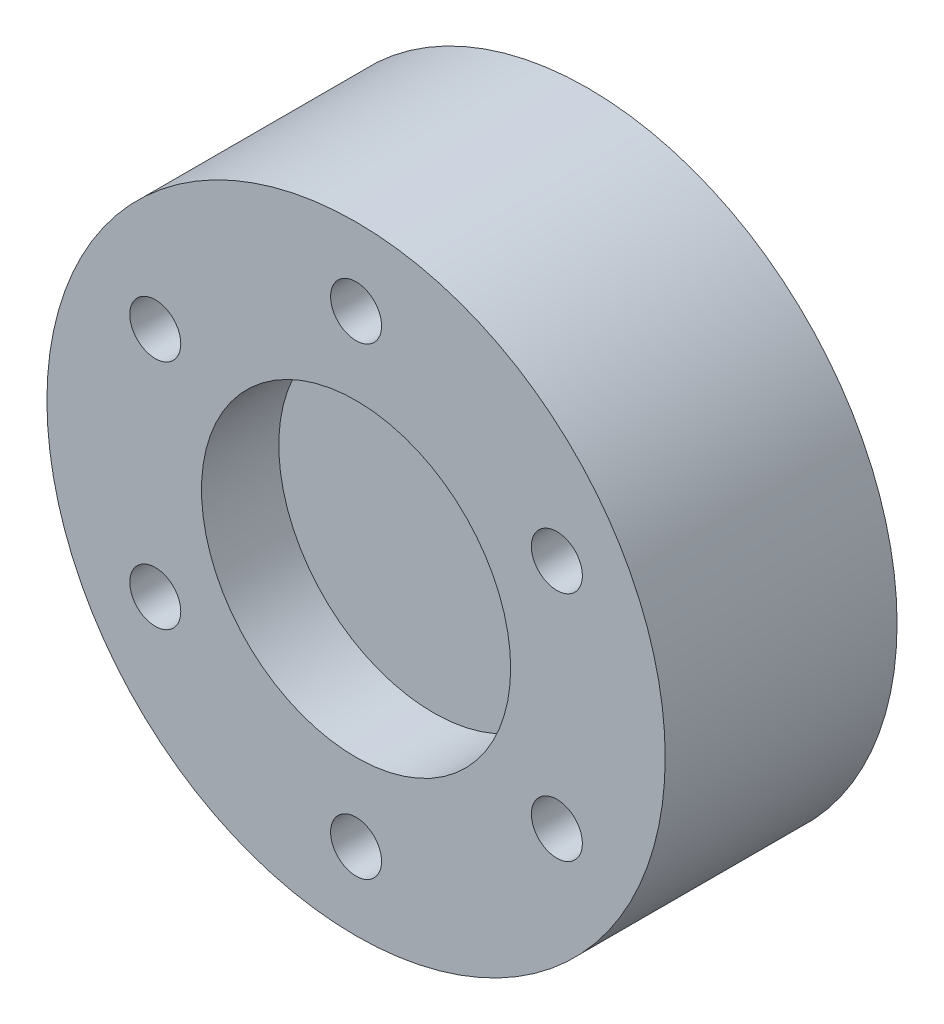
ISO-10303-21;
HEADER;
FILE_DESCRIPTION(('STEP AP214'),'2;1');
FILE_NAME('part.step','',(''),(''),'','','');
FILE_SCHEMA(('AUTOMOTIVE_DESIGN { 1 0 10303 214 1 1 1 1 }'));
ENDSEC;
DATA;
#1=APPLICATION_CONTEXT('core data for automotive mechanical design processes');
#2=APPLICATION_PROTOCOL_DEFINITION('international standard','automotive_design',2000,#1);
#3=PRODUCT_CONTEXT('',#1,'mechanical');
#4=PRODUCT('Part','Part','',(#3));
#5=PRODUCT_RELATED_PRODUCT_CATEGORY('part','',(#4));
#6=PRODUCT_DEFINITION_FORMATION('','',#4);
#7=PRODUCT_DEFINITION_CONTEXT('part definition',#1,'design');
#8=PRODUCT_DEFINITION('design','',#6,#7);
#9=PRODUCT_DEFINITION_SHAPE('','',#8);
#10=(LENGTH_UNIT() NAMED_UNIT(*) SI_UNIT(.MILLI.,.METRE.));
#11=(NAMED_UNIT(*) PLANE_ANGLE_UNIT() SI_UNIT($,.RADIAN.));
#12=(NAMED_UNIT(*) SI_UNIT($,.STERADIAN.) SOLID_ANGLE_UNIT());
#13=UNCERTAINTY_MEASURE_WITH_UNIT(LENGTH_MEASURE(1.E-05),#10,'distance_accuracy_value','');
#14=(GEOMETRIC_REPRESENTATION_CONTEXT(3) GLOBAL_UNCERTAINTY_ASSIGNED_CONTEXT((#13)) GLOBAL_UNIT_ASSIGNED_CONTEXT((#10,
#11,#12)) REPRESENTATION_CONTEXT('',''));
#15=CARTESIAN_POINT('',(0.,0.,0.));
#16=DIRECTION('',(0.,0.,1.));
#17=DIRECTION('',(1.,0.,0.));
#18=AXIS2_PLACEMENT_3D('',#15,#16,#17);
#19=CARTESIAN_POINT('',(0.,0.,15.));
#20=DIRECTION('',(0.,0.,-1.));
#21=DIRECTION('',(-1.,0.,0.));
#22=AXIS2_PLACEMENT_3D('',#19,#20,#21);
#23=CYLINDRICAL_SURFACE('',#22,20.);
#24=CARTESIAN_POINT('',(0.,0.,15.));
#25=DIRECTION('',(0.,0.,1.));
#26=DIRECTION('',(1.,0.,0.));
#27=AXIS2_PLACEMENT_3D('',#24,#25,#26);
#28=CIRCLE('',#27,20.);
#29=CARTESIAN_POINT('',(20.,0.,15.));
#30=VERTEX_POINT('',#29);
#31=EDGE_CURVE('E11',#30,#30,#28,.T.);
#32=ORIENTED_EDGE('',*,*,#31,.F.);
#33=EDGE_LOOP('',(#32));
#34=FACE_BOUND('',#33,.T.);
#35=CARTESIAN_POINT('',(0.,0.,0.));
#36=DIRECTION('',(0.,0.,1.));
#37=DIRECTION('',(1.,0.,0.));
#38=AXIS2_PLACEMENT_3D('',#35,#36,#37);
#39=CIRCLE('',#38,20.);
#40=CARTESIAN_POINT('',(20.,0.,0.));
#41=VERTEX_POINT('',#40);
#42=EDGE_CURVE('E41',#41,#41,#39,.T.);
#43=ORIENTED_EDGE('',*,*,#42,.T.);
#44=EDGE_LOOP('',(#43));
#45=FACE_BOUND('',#44,.T.);
#46=ADVANCED_FACE('F38',(#34,#45),#23,.T.);
#47=CARTESIAN_POINT('',(0.,0.,15.));
#48=DIRECTION('',(0.,0.,1.));
#49=DIRECTION('',(1.,0.,0.));
#50=AXIS2_PLACEMENT_3D('',#47,#48,#49);
#51=PLANE('',#50);
#52=CARTESIAN_POINT('',(12.9903810567665,7.50000000000015,15.));
#53=DIRECTION('',(0.,0.,1.));
#54=DIRECTION('',(1.,0.,0.));
#55=AXIS2_PLACEMENT_3D('',#52,#53,#54);
#56=CIRCLE('',#55,1.64999999999999);
#57=CARTESIAN_POINT('',(14.6403810567665,7.50000000000015,15.));
#58=VERTEX_POINT('',#57);
#59=EDGE_CURVE('E75',#58,#58,#56,.T.);
#60=ORIENTED_EDGE('',*,*,#59,.F.);
#61=EDGE_LOOP('',(#60));
#62=FACE_BOUND('',#61,.T.);
#63=CARTESIAN_POINT('',(12.9903810567666,-7.49999999999988,15.));
#64=DIRECTION('',(0.,0.,1.));
#65=DIRECTION('',(1.,0.,0.));
#66=AXIS2_PLACEMENT_3D('',#63,#64,#65);
#67=CIRCLE('',#66,1.64999999999999);
#68=CARTESIAN_POINT('',(14.6403810567666,-7.49999999999988,15.));
#69=VERTEX_POINT('',#68);
#70=EDGE_CURVE('E74',#69,#69,#67,.T.);
#71=ORIENTED_EDGE('',*,*,#70,.F.);
#72=EDGE_LOOP('',(#71));
#73=FACE_BOUND('',#72,.T.);
#74=CARTESIAN_POINT('',(0.,-15.,15.));
#75=DIRECTION('',(0.,0.,1.));
#76=DIRECTION('',(1.,0.,0.));
#77=AXIS2_PLACEMENT_3D('',#74,#75,#76);
#78=CIRCLE('',#77,1.64999999999999);
#79=CARTESIAN_POINT('',(1.64999999999999,-15.,15.));
#80=VERTEX_POINT('',#79);
#81=EDGE_CURVE('E87',#80,#80,#78,.T.);
#82=ORIENTED_EDGE('',*,*,#81,.F.);
#83=EDGE_LOOP('',(#82));
#84=FACE_BOUND('',#83,.T.);
#85=CARTESIAN_POINT('',(-12.9903810567665,-7.50000000000006,15.));
#86=DIRECTION('',(0.,0.,1.));
#87=DIRECTION('',(1.,0.,0.));
#88=AXIS2_PLACEMENT_3D('',#85,#86,#87);
#89=CIRCLE('',#88,1.64999999999999);
#90=CARTESIAN_POINT('',(-11.3403810567666,-7.50000000000006,15.));
#91=VERTEX_POINT('',#90);
#92=EDGE_CURVE('E93',#91,#91,#89,.T.);
#93=ORIENTED_EDGE('',*,*,#92,.F.);
#94=EDGE_LOOP('',(#93));
#95=FACE_BOUND('',#94,.T.);
#96=CARTESIAN_POINT('',(-12.9903810567666,7.49999999999997,15.));
#97=DIRECTION('',(0.,0.,1.));
#98=DIRECTION('',(1.,0.,0.));
#99=AXIS2_PLACEMENT_3D('',#96,#97,#98);
#100=CIRCLE('',#99,1.64999999999999);
#101=CARTESIAN_POINT('',(-11.3403810567666,7.49999999999997,15.));
#102=VERTEX_POINT('',#101);
#103=EDGE_CURVE('E99',#102,#102,#100,.T.);
#104=ORIENTED_EDGE('',*,*,#103,.F.);
#105=EDGE_LOOP('',(#104));
#106=FACE_BOUND('',#105,.T.);
#107=CARTESIAN_POINT('',(0.,15.,15.));
#108=DIRECTION('',(0.,0.,1.));
#109=DIRECTION('',(1.,0.,0.));
#110=AXIS2_PLACEMENT_3D('',#107,#108,#109);
#111=CIRCLE('',#110,1.64999999999999);
#112=CARTESIAN_POINT('',(1.64999999999999,15.,15.));
#113=VERTEX_POINT('',#112);
#114=EDGE_CURVE('E105',#113,#113,#111,.T.);
#115=ORIENTED_EDGE('',*,*,#114,.F.);
#116=EDGE_LOOP('',(#115));
#117=FACE_BOUND('',#116,.T.);
#118=CARTESIAN_POINT('',(0.,0.,15.));
#119=DIRECTION('',(0.,0.,1.));
#120=DIRECTION('',(1.,0.,0.));
#121=AXIS2_PLACEMENT_3D('',#118,#119,#120);
#122=CIRCLE('',#121,10.);
#123=CARTESIAN_POINT('',(10.,0.,15.));
#124=VERTEX_POINT('',#123);
#125=EDGE_CURVE('E111',#124,#124,#122,.T.);
#126=ORIENTED_EDGE('',*,*,#125,.F.);
#127=EDGE_LOOP('',(#126));
#128=FACE_BOUND('',#127,.T.);
#129=ORIENTED_EDGE('',*,*,#31,.T.);
#130=EDGE_LOOP('',(#129));
#131=FACE_BOUND('',#130,.T.);
#132=ADVANCED_FACE('F120',(#62,#73,#84,#95,#106,#117,#128,#131),#51,.T.);
#133=CARTESIAN_POINT('',(0.,0.,0.));
#134=DIRECTION('',(0.,0.,1.));
#135=DIRECTION('',(1.,0.,0.));
#136=AXIS2_PLACEMENT_3D('',#133,#134,#135);
#137=PLANE('',#136);
#138=CARTESIAN_POINT('',(0.,0.,0.));
#139=DIRECTION('',(0.,0.,-1.));
#140=DIRECTION('',(-1.,0.,0.));
#141=AXIS2_PLACEMENT_3D('',#138,#139,#140);
#142=CIRCLE('',#141,17.5);
#143=CARTESIAN_POINT('',(-17.5,0.,0.));
#144=VERTEX_POINT('',#143);
#145=EDGE_CURVE('E196',#144,#144,#142,.T.);
#146=ORIENTED_EDGE('',*,*,#145,.F.);
#147=EDGE_LOOP('',(#146));
#148=FACE_BOUND('',#147,.T.);
#149=ORIENTED_EDGE('',*,*,#42,.F.);
#150=EDGE_LOOP('',(#149));
#151=FACE_BOUND('',#150,.T.);
#152=ADVANCED_FACE('F123',(#148,#151),#137,.F.);
#153=CARTESIAN_POINT('',(0.,0.,10.));
#154=DIRECTION('',(0.,0.,1.));
#155=DIRECTION('',(1.,0.,0.));
#156=AXIS2_PLACEMENT_3D('',#153,#154,#155);
#157=CYLINDRICAL_SURFACE('',#156,10.);
#158=CARTESIAN_POINT('',(0.,0.,10.));
#159=DIRECTION('',(0.,0.,1.));
#160=DIRECTION('',(1.,0.,0.));
#161=AXIS2_PLACEMENT_3D('',#158,#159,#160);
#162=CIRCLE('',#161,10.);
#163=CARTESIAN_POINT('',(10.,0.,10.));
#164=VERTEX_POINT('',#163);
#165=EDGE_CURVE('E112',#164,#164,#162,.T.);
#166=ORIENTED_EDGE('',*,*,#165,.F.);
#167=EDGE_LOOP('',(#166));
#168=FACE_BOUND('',#167,.T.);
#169=ORIENTED_EDGE('',*,*,#125,.T.);
#170=EDGE_LOOP('',(#169));
#171=FACE_BOUND('',#170,.T.);
#172=ADVANCED_FACE('F118',(#168,#171),#157,.F.);
#173=CARTESIAN_POINT('',(0.,0.,10.));
#174=DIRECTION('',(0.,0.,1.));
#175=DIRECTION('',(1.,0.,0.));
#176=AXIS2_PLACEMENT_3D('',#173,#174,#175);
#177=PLANE('',#176);
#178=ORIENTED_EDGE('',*,*,#165,.T.);
#179=EDGE_LOOP('',(#178));
#180=FACE_BOUND('',#179,.T.);
#181=ADVANCED_FACE('F138',(#180),#177,.T.);
#182=CARTESIAN_POINT('',(0.,15.,7.9));
#183=DIRECTION('',(0.,0.,1.));
#184=DIRECTION('',(1.,0.,0.));
#185=AXIS2_PLACEMENT_3D('',#182,#183,#184);
#186=CONICAL_SURFACE('',#185,1.64999999999999,1.02974425867665);
#187=CARTESIAN_POINT('',(0.,15.,6.90857997860452));
#188=VERTEX_POINT('',#187);
#189=VERTEX_LOOP('',#188);
#190=FACE_BOUND('',#189,.T.);
#191=CARTESIAN_POINT('',(0.,15.,7.9));
#192=DIRECTION('',(0.,0.,1.));
#193=DIRECTION('',(1.,0.,0.));
#194=AXIS2_PLACEMENT_3D('',#191,#192,#193);
#195=CIRCLE('',#194,1.64999999999999);
#196=CARTESIAN_POINT('',(1.64999999999999,15.,7.9));
#197=VERTEX_POINT('',#196);
#198=EDGE_CURVE('E108',#197,#197,#195,.T.);
#199=ORIENTED_EDGE('',*,*,#198,.T.);
#200=EDGE_LOOP('',(#199));
#201=FACE_BOUND('',#200,.T.);
#202=ADVANCED_FACE('F145',(#190,#201),#186,.F.);
#203=CARTESIAN_POINT('',(0.,15.,15.));
#204=DIRECTION('',(0.,0.,1.));
#205=DIRECTION('',(1.,0.,0.));
#206=AXIS2_PLACEMENT_3D('',#203,#204,#205);
#207=CYLINDRICAL_SURFACE('',#206,1.64999999999999);
#208=ORIENTED_EDGE('',*,*,#198,.F.);
#209=EDGE_LOOP('',(#208));
#210=FACE_BOUND('',#209,.T.);
#211=ORIENTED_EDGE('',*,*,#114,.T.);
#212=EDGE_LOOP('',(#211));
#213=FACE_BOUND('',#212,.T.);
#214=ADVANCED_FACE('F149',(#210,#213),#207,.F.);
#215=CARTESIAN_POINT('',(-12.9903810567666,7.49999999999997,7.9));
#216=DIRECTION('',(0.,0.,1.));
#217=DIRECTION('',(1.,0.,0.));
#218=AXIS2_PLACEMENT_3D('',#215,#216,#217);
#219=CONICAL_SURFACE('',#218,1.64999999999999,1.02974425867665);
#220=CARTESIAN_POINT('',(-12.9903810567666,7.49999999999997,6.90857997860452));
#221=VERTEX_POINT('',#220);
#222=VERTEX_LOOP('',#221);
#223=FACE_BOUND('',#222,.T.);
#224=CARTESIAN_POINT('',(-12.9903810567666,7.49999999999997,7.9));
#225=DIRECTION('',(0.,0.,1.));
#226=DIRECTION('',(1.,0.,0.));
#227=AXIS2_PLACEMENT_3D('',#224,#225,#226);
#228=CIRCLE('',#227,1.64999999999999);
#229=CARTESIAN_POINT('',(-11.3403810567666,7.49999999999997,7.9));
#230=VERTEX_POINT('',#229);
#231=EDGE_CURVE('E102',#230,#230,#228,.T.);
#232=ORIENTED_EDGE('',*,*,#231,.T.);
#233=EDGE_LOOP('',(#232));
#234=FACE_BOUND('',#233,.T.);
#235=ADVANCED_FACE('F152',(#223,#234),#219,.F.);
#236=CARTESIAN_POINT('',(-12.9903810567666,7.49999999999997,15.));
#237=DIRECTION('',(0.,0.,1.));
#238=DIRECTION('',(1.,0.,0.));
#239=AXIS2_PLACEMENT_3D('',#236,#237,#238);
#240=CYLINDRICAL_SURFACE('',#239,1.64999999999999);
#241=ORIENTED_EDGE('',*,*,#231,.F.);
#242=EDGE_LOOP('',(#241));
#243=FACE_BOUND('',#242,.T.);
#244=ORIENTED_EDGE('',*,*,#103,.T.);
#245=EDGE_LOOP('',(#244));
#246=FACE_BOUND('',#245,.T.);
#247=ADVANCED_FACE('F156',(#243,#246),#240,.F.);
#248=CARTESIAN_POINT('',(-12.9903810567665,-7.50000000000006,7.9));
#249=DIRECTION('',(0.,0.,1.));
#250=DIRECTION('',(1.,0.,0.));
#251=AXIS2_PLACEMENT_3D('',#248,#249,#250);
#252=CONICAL_SURFACE('',#251,1.64999999999999,1.02974425867665);
#253=CARTESIAN_POINT('',(-12.9903810567665,-7.50000000000006,6.90857997860452));
#254=VERTEX_POINT('',#253);
#255=VERTEX_LOOP('',#254);
#256=FACE_BOUND('',#255,.T.);
#257=CARTESIAN_POINT('',(-12.9903810567665,-7.50000000000006,7.9));
#258=DIRECTION('',(0.,0.,1.));
#259=DIRECTION('',(1.,0.,0.));
#260=AXIS2_PLACEMENT_3D('',#257,#258,#259);
#261=CIRCLE('',#260,1.64999999999999);
#262=CARTESIAN_POINT('',(-11.3403810567666,-7.50000000000006,7.9));
#263=VERTEX_POINT('',#262);
#264=EDGE_CURVE('E96',#263,#263,#261,.T.);
#265=ORIENTED_EDGE('',*,*,#264,.T.);
#266=EDGE_LOOP('',(#265));
#267=FACE_BOUND('',#266,.T.);
#268=ADVANCED_FACE('F159',(#256,#267),#252,.F.);
#269=CARTESIAN_POINT('',(-12.9903810567665,-7.50000000000006,15.));
#270=DIRECTION('',(0.,0.,1.));
#271=DIRECTION('',(1.,0.,0.));
#272=AXIS2_PLACEMENT_3D('',#269,#270,#271);
#273=CYLINDRICAL_SURFACE('',#272,1.64999999999999);
#274=ORIENTED_EDGE('',*,*,#264,.F.);
#275=EDGE_LOOP('',(#274));
#276=FACE_BOUND('',#275,.T.);
#277=ORIENTED_EDGE('',*,*,#92,.T.);
#278=EDGE_LOOP('',(#277));
#279=FACE_BOUND('',#278,.T.);
#280=ADVANCED_FACE('F163',(#276,#279),#273,.F.);
#281=CARTESIAN_POINT('',(0.,-15.,7.9));
#282=DIRECTION('',(0.,0.,1.));
#283=DIRECTION('',(1.,0.,0.));
#284=AXIS2_PLACEMENT_3D('',#281,#282,#283);
#285=CONICAL_SURFACE('',#284,1.64999999999999,1.02974425867665);
#286=CARTESIAN_POINT('',(0.,-15.,6.90857997860452));
#287=VERTEX_POINT('',#286);
#288=VERTEX_LOOP('',#287);
#289=FACE_BOUND('',#288,.T.);
#290=CARTESIAN_POINT('',(0.,-15.,7.9));
#291=DIRECTION('',(0.,0.,1.));
#292=DIRECTION('',(1.,0.,0.));
#293=AXIS2_PLACEMENT_3D('',#290,#291,#292);
#294=CIRCLE('',#293,1.64999999999999);
#295=CARTESIAN_POINT('',(1.64999999999999,-15.,7.9));
#296=VERTEX_POINT('',#295);
#297=EDGE_CURVE('E90',#296,#296,#294,.T.);
#298=ORIENTED_EDGE('',*,*,#297,.T.);
#299=EDGE_LOOP('',(#298));
#300=FACE_BOUND('',#299,.T.);
#301=ADVANCED_FACE('F167',(#289,#300),#285,.F.);
#302=CARTESIAN_POINT('',(0.,-15.,15.));
#303=DIRECTION('',(0.,0.,1.));
#304=DIRECTION('',(1.,0.,0.));
#305=AXIS2_PLACEMENT_3D('',#302,#303,#304);
#306=CYLINDRICAL_SURFACE('',#305,1.64999999999999);
#307=ORIENTED_EDGE('',*,*,#297,.F.);
#308=EDGE_LOOP('',(#307));
#309=FACE_BOUND('',#308,.T.);
#310=ORIENTED_EDGE('',*,*,#81,.T.);
#311=EDGE_LOOP('',(#310));
#312=FACE_BOUND('',#311,.T.);
#313=ADVANCED_FACE('F171',(#309,#312),#306,.F.);
#314=CARTESIAN_POINT('',(12.9903810567666,-7.49999999999988,7.9));
#315=DIRECTION('',(0.,0.,1.));
#316=DIRECTION('',(1.,0.,0.));
#317=AXIS2_PLACEMENT_3D('',#314,#315,#316);
#318=CONICAL_SURFACE('',#317,1.64999999999999,1.02974425867665);
#319=CARTESIAN_POINT('',(12.9903810567666,-7.49999999999988,6.90857997860452));
#320=VERTEX_POINT('',#319);
#321=VERTEX_LOOP('',#320);
#322=FACE_BOUND('',#321,.T.);
#323=CARTESIAN_POINT('',(12.9903810567666,-7.49999999999988,7.9));
#324=DIRECTION('',(0.,0.,1.));
#325=DIRECTION('',(1.,0.,0.));
#326=AXIS2_PLACEMENT_3D('',#323,#324,#325);
#327=CIRCLE('',#326,1.64999999999999);
#328=CARTESIAN_POINT('',(14.6403810567666,-7.49999999999988,7.9));
#329=VERTEX_POINT('',#328);
#330=EDGE_CURVE('E78',#329,#329,#327,.T.);
#331=ORIENTED_EDGE('',*,*,#330,.T.);
#332=EDGE_LOOP('',(#331));
#333=FACE_BOUND('',#332,.T.);
#334=ADVANCED_FACE('F175',(#322,#333),#318,.F.);
#335=CARTESIAN_POINT('',(12.9903810567666,-7.49999999999988,15.));
#336=DIRECTION('',(0.,0.,1.));
#337=DIRECTION('',(1.,0.,0.));
#338=AXIS2_PLACEMENT_3D('',#335,#336,#337);
#339=CYLINDRICAL_SURFACE('',#338,1.64999999999999);
#340=ORIENTED_EDGE('',*,*,#330,.F.);
#341=EDGE_LOOP('',(#340));
#342=FACE_BOUND('',#341,.T.);
#343=ORIENTED_EDGE('',*,*,#70,.T.);
#344=EDGE_LOOP('',(#343));
#345=FACE_BOUND('',#344,.T.);
#346=ADVANCED_FACE('F68',(#342,#345),#339,.F.);
#347=CARTESIAN_POINT('',(12.9903810567665,7.50000000000015,7.9));
#348=DIRECTION('',(0.,0.,1.));
#349=DIRECTION('',(1.,0.,0.));
#350=AXIS2_PLACEMENT_3D('',#347,#348,#349);
#351=CONICAL_SURFACE('',#350,1.64999999999999,1.02974425867665);
#352=CARTESIAN_POINT('',(12.9903810567665,7.50000000000015,6.90857997860452));
#353=VERTEX_POINT('',#352);
#354=VERTEX_LOOP('',#353);
#355=FACE_BOUND('',#354,.T.);
#356=CARTESIAN_POINT('',(12.9903810567665,7.50000000000015,7.9));
#357=DIRECTION('',(0.,0.,1.));
#358=DIRECTION('',(1.,0.,0.));
#359=AXIS2_PLACEMENT_3D('',#356,#357,#358);
#360=CIRCLE('',#359,1.64999999999999);
#361=CARTESIAN_POINT('',(14.6403810567665,7.50000000000015,7.9));
#362=VERTEX_POINT('',#361);
#363=EDGE_CURVE('E72',#362,#362,#360,.T.);
#364=ORIENTED_EDGE('',*,*,#363,.T.);
#365=EDGE_LOOP('',(#364));
#366=FACE_BOUND('',#365,.T.);
#367=ADVANCED_FACE('F64',(#355,#366),#351,.F.);
#368=CARTESIAN_POINT('',(12.9903810567665,7.50000000000015,15.));
#369=DIRECTION('',(0.,0.,1.));
#370=DIRECTION('',(1.,0.,0.));
#371=AXIS2_PLACEMENT_3D('',#368,#369,#370);
#372=CYLINDRICAL_SURFACE('',#371,1.64999999999999);
#373=ORIENTED_EDGE('',*,*,#363,.F.);
#374=EDGE_LOOP('',(#373));
#375=FACE_BOUND('',#374,.T.);
#376=ORIENTED_EDGE('',*,*,#59,.T.);
#377=EDGE_LOOP('',(#376));
#378=FACE_BOUND('',#377,.T.);
#379=ADVANCED_FACE('F67',(#375,#378),#372,.F.);
#380=CARTESIAN_POINT('',(0.,0.,3.));
#381=DIRECTION('',(0.,0.,-1.));
#382=DIRECTION('',(-1.,0.,0.));
#383=AXIS2_PLACEMENT_3D('',#380,#381,#382);
#384=CYLINDRICAL_SURFACE('',#383,17.5);
#385=CARTESIAN_POINT('',(0.,0.,3.));
#386=DIRECTION('',(0.,0.,-1.));
#387=DIRECTION('',(-1.,0.,0.));
#388=AXIS2_PLACEMENT_3D('',#385,#386,#387);
#389=CIRCLE('',#388,17.5);
#390=CARTESIAN_POINT('',(-17.5,0.,3.));
#391=VERTEX_POINT('',#390);
#392=EDGE_CURVE('E81',#391,#391,#389,.T.);
#393=ORIENTED_EDGE('',*,*,#392,.F.);
#394=EDGE_LOOP('',(#393));
#395=FACE_BOUND('',#394,.T.);
#396=ORIENTED_EDGE('',*,*,#145,.T.);
#397=EDGE_LOOP('',(#396));
#398=FACE_BOUND('',#397,.T.);
#399=ADVANCED_FACE('F185',(#395,#398),#384,.F.);
#400=CARTESIAN_POINT('',(0.,0.,3.));
#401=DIRECTION('',(0.,0.,-1.));
#402=DIRECTION('',(-1.,0.,0.));
#403=AXIS2_PLACEMENT_3D('',#400,#401,#402);
#404=PLANE('',#403);
#405=ORIENTED_EDGE('',*,*,#392,.T.);
#406=EDGE_LOOP('',(#405));
#407=FACE_BOUND('',#406,.T.);
#408=ADVANCED_FACE('F188',(#407),#404,.T.);
#409=CLOSED_SHELL('',(#46,#132,#152,#172,#181,#202,#214,#235,#247,#268,#280,#301,#313,#334,#346,
#367,#379,#399,#408));
#410=MANIFOLD_SOLID_BREP('B2',#409);
#411=ADVANCED_BREP_SHAPE_REPRESENTATION('',(#18,#410),#14);
#412=SHAPE_DEFINITION_REPRESENTATION(#9,#411);
ENDSEC;
END-ISO-10303-21;
